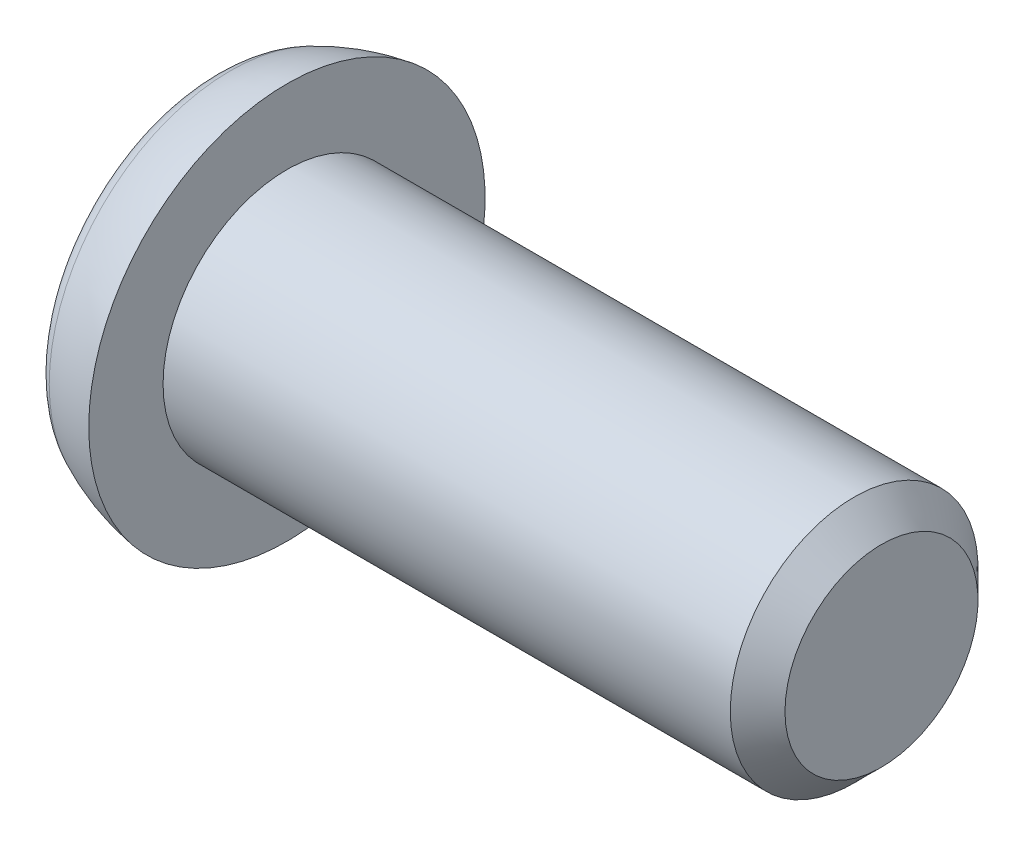
ISO-10303-21;
HEADER;
FILE_DESCRIPTION(('STEP AP214'),'2;1');
FILE_NAME('part.step','',(''),(''),'','','');
FILE_SCHEMA(('AUTOMOTIVE_DESIGN { 1 0 10303 214 1 1 1 1 }'));
ENDSEC;
DATA;
#1=APPLICATION_CONTEXT('core data for automotive mechanical design processes');
#2=APPLICATION_PROTOCOL_DEFINITION('international standard','automotive_design',2000,#1);
#3=PRODUCT_CONTEXT('',#1,'mechanical');
#4=PRODUCT('Part','Part','',(#3));
#5=PRODUCT_RELATED_PRODUCT_CATEGORY('part','',(#4));
#6=PRODUCT_DEFINITION_FORMATION('','',#4);
#7=PRODUCT_DEFINITION_CONTEXT('part definition',#1,'design');
#8=PRODUCT_DEFINITION('design','',#6,#7);
#9=PRODUCT_DEFINITION_SHAPE('','',#8);
#10=(LENGTH_UNIT() NAMED_UNIT(*) SI_UNIT(.MILLI.,.METRE.));
#11=(NAMED_UNIT(*) PLANE_ANGLE_UNIT() SI_UNIT($,.RADIAN.));
#12=(NAMED_UNIT(*) SI_UNIT($,.STERADIAN.) SOLID_ANGLE_UNIT());
#13=UNCERTAINTY_MEASURE_WITH_UNIT(LENGTH_MEASURE(1.E-05),#10,'distance_accuracy_value','');
#14=(GEOMETRIC_REPRESENTATION_CONTEXT(3) GLOBAL_UNCERTAINTY_ASSIGNED_CONTEXT((#13)) GLOBAL_UNIT_ASSIGNED_CONTEXT((#10,
#11,#12)) REPRESENTATION_CONTEXT('',''));
#15=CARTESIAN_POINT('',(0.,0.,0.));
#16=DIRECTION('',(0.,0.,1.));
#17=DIRECTION('',(1.,0.,0.));
#18=AXIS2_PLACEMENT_3D('',#15,#16,#17);
#19=CARTESIAN_POINT('',(-1.18104045222202,0.553965306488662,0.2));
#20=DIRECTION('',(0.,0.,-1.));
#21=DIRECTION('',(-1.,0.,0.));
#22=AXIS2_PLACEMENT_3D('',#19,#20,#21);
#23=CYLINDRICAL_SURFACE('',#22,1.59999999999999);
#24=CARTESIAN_POINT('',(-1.18104045222202,0.553965306488662,0.2));
#25=DIRECTION('',(0.,0.,1.));
#26=DIRECTION('',(1.,0.,0.));
#27=AXIS2_PLACEMENT_3D('',#24,#25,#26);
#28=CIRCLE('',#27,1.59999999999999);
#29=CARTESIAN_POINT('',(-0.8,-1.,0.2));
#30=VERTEX_POINT('',#29);
#31=CARTESIAN_POINT('',(0.230177573673136,-0.2,0.2));
#32=VERTEX_POINT('',#31);
#33=EDGE_CURVE('E193',#30,#32,#28,.T.);
#34=ORIENTED_EDGE('',*,*,#33,.T.);
#35=DIRECTION('',(0.,0.,-1.));
#36=VECTOR('',#35,1.);
#37=CARTESIAN_POINT('',(0.230177573673136,-0.2,0.2));
#38=LINE('',#37,#36);
#39=CARTESIAN_POINT('',(0.230177573673136,-0.2,-0.2));
#40=VERTEX_POINT('',#39);
#41=EDGE_CURVE('E136',#32,#40,#38,.T.);
#42=ORIENTED_EDGE('',*,*,#41,.T.);
#43=CARTESIAN_POINT('',(-1.18104045222202,0.553965306488662,-0.2));
#44=DIRECTION('',(0.,0.,1.));
#45=DIRECTION('',(1.,0.,0.));
#46=AXIS2_PLACEMENT_3D('',#43,#44,#45);
#47=CIRCLE('',#46,1.59999999999999);
#48=CARTESIAN_POINT('',(-0.8,-1.,-0.2));
#49=VERTEX_POINT('',#48);
#50=EDGE_CURVE('E182',#49,#40,#47,.T.);
#51=ORIENTED_EDGE('',*,*,#50,.F.);
#52=DIRECTION('',(0.,0.,-1.));
#53=VECTOR('',#52,1.);
#54=CARTESIAN_POINT('',(-0.8,-1.,0.2));
#55=LINE('',#54,#53);
#56=EDGE_CURVE('E204',#30,#49,#55,.T.);
#57=ORIENTED_EDGE('',*,*,#56,.F.);
#58=EDGE_LOOP('',(#34,#42,#51,#57));
#59=FACE_BOUND('',#58,.T.);
#60=ADVANCED_FACE('F36',(#59),#23,.F.);
#61=CARTESIAN_POINT('',(-1.18104045222202,0.553965306488662,0.2));
#62=DIRECTION('',(0.,0.,1.));
#63=DIRECTION('',(1.,0.,0.));
#64=AXIS2_PLACEMENT_3D('',#61,#62,#63);
#65=PLANE('',#64);
#66=DIRECTION('',(-1.,0.,0.));
#67=VECTOR('',#66,1.);
#68=CARTESIAN_POINT('',(-1.18104045222202,-0.2,0.2));
#69=LINE('',#68,#67);
#70=CARTESIAN_POINT('',(-0.8,-0.2,0.2));
#71=VERTEX_POINT('',#70);
#72=EDGE_CURVE('E165',#32,#71,#69,.T.);
#73=ORIENTED_EDGE('',*,*,#72,.F.);
#74=ORIENTED_EDGE('',*,*,#33,.F.);
#75=DIRECTION('',(0.,-1.,0.));
#76=VECTOR('',#75,1.);
#77=CARTESIAN_POINT('',(-0.8,1.,0.2));
#78=LINE('',#77,#76);
#79=EDGE_CURVE('E200',#71,#30,#78,.T.);
#80=ORIENTED_EDGE('',*,*,#79,.F.);
#81=EDGE_LOOP('',(#73,#74,#80));
#82=FACE_BOUND('',#81,.T.);
#83=ADVANCED_FACE('F282',(#82),#65,.F.);
#84=CARTESIAN_POINT('',(-1.18104045222202,0.553965306488662,-0.2));
#85=DIRECTION('',(0.,0.,1.));
#86=DIRECTION('',(1.,0.,0.));
#87=AXIS2_PLACEMENT_3D('',#84,#85,#86);
#88=PLANE('',#87);
#89=ORIENTED_EDGE('',*,*,#50,.T.);
#90=DIRECTION('',(-1.,0.,0.));
#91=VECTOR('',#90,1.);
#92=CARTESIAN_POINT('',(-1.18104045222202,-0.2,-0.2));
#93=LINE('',#92,#91);
#94=CARTESIAN_POINT('',(-0.8,-0.2,-0.2));
#95=VERTEX_POINT('',#94);
#96=EDGE_CURVE('E232',#40,#95,#93,.T.);
#97=ORIENTED_EDGE('',*,*,#96,.T.);
#98=DIRECTION('',(0.,-1.,0.));
#99=VECTOR('',#98,1.);
#100=CARTESIAN_POINT('',(-0.8,1.,-0.2));
#101=LINE('',#100,#99);
#102=EDGE_CURVE('E188',#95,#49,#101,.T.);
#103=ORIENTED_EDGE('',*,*,#102,.T.);
#104=EDGE_LOOP('',(#89,#97,#103));
#105=FACE_BOUND('',#104,.T.);
#106=ADVANCED_FACE('F288',(#105),#88,.T.);
#107=CARTESIAN_POINT('',(-0.8,0.,0.));
#108=DIRECTION('',(1.,0.,0.));
#109=DIRECTION('',(0.,0.,-1.));
#110=AXIS2_PLACEMENT_3D('',#107,#108,#109);
#111=PLANE('',#110);
#112=DIRECTION('',(0.,-1.,0.));
#113=VECTOR('',#112,1.);
#114=CARTESIAN_POINT('',(-0.8,0.2,-1.));
#115=LINE('',#114,#113);
#116=CARTESIAN_POINT('',(-0.8,0.2,-1.));
#117=VERTEX_POINT('',#116);
#118=CARTESIAN_POINT('',(-0.8,-0.2,-1.));
#119=VERTEX_POINT('',#118);
#120=EDGE_CURVE('E127',#117,#119,#115,.T.);
#121=ORIENTED_EDGE('',*,*,#120,.F.);
#122=DIRECTION('',(0.,0.,1.));
#123=VECTOR('',#122,1.);
#124=CARTESIAN_POINT('',(-0.8,0.2,-1.));
#125=LINE('',#124,#123);
#126=CARTESIAN_POINT('',(-0.8,0.2,-0.2));
#127=VERTEX_POINT('',#126);
#128=EDGE_CURVE('E155',#117,#127,#125,.T.);
#129=ORIENTED_EDGE('',*,*,#128,.T.);
#130=CARTESIAN_POINT('',(-0.8,1.,-0.2));
#131=VERTEX_POINT('',#130);
#132=EDGE_CURVE('E189',#131,#127,#101,.T.);
#133=ORIENTED_EDGE('',*,*,#132,.F.);
#134=DIRECTION('',(0.,0.,-1.));
#135=VECTOR('',#134,1.);
#136=CARTESIAN_POINT('',(-0.8,1.,0.2));
#137=LINE('',#136,#135);
#138=CARTESIAN_POINT('',(-0.8,1.,0.2));
#139=VERTEX_POINT('',#138);
#140=EDGE_CURVE('E207',#139,#131,#137,.T.);
#141=ORIENTED_EDGE('',*,*,#140,.F.);
#142=CARTESIAN_POINT('',(-0.8,0.2,0.2));
#143=VERTEX_POINT('',#142);
#144=EDGE_CURVE('E201',#139,#143,#78,.T.);
#145=ORIENTED_EDGE('',*,*,#144,.T.);
#146=CARTESIAN_POINT('',(-0.8,0.2,1.));
#147=VERTEX_POINT('',#146);
#148=EDGE_CURVE('E154',#143,#147,#125,.T.);
#149=ORIENTED_EDGE('',*,*,#148,.T.);
#150=DIRECTION('',(0.,-1.,0.));
#151=VECTOR('',#150,1.);
#152=CARTESIAN_POINT('',(-0.8,0.2,1.));
#153=LINE('',#152,#151);
#154=CARTESIAN_POINT('',(-0.8,-0.2,1.));
#155=VERTEX_POINT('',#154);
#156=EDGE_CURVE('E158',#147,#155,#153,.T.);
#157=ORIENTED_EDGE('',*,*,#156,.T.);
#158=DIRECTION('',(0.,0.,1.));
#159=VECTOR('',#158,1.);
#160=CARTESIAN_POINT('',(-0.8,-0.2,-1.));
#161=LINE('',#160,#159);
#162=EDGE_CURVE('E141',#71,#155,#161,.T.);
#163=ORIENTED_EDGE('',*,*,#162,.F.);
#164=ORIENTED_EDGE('',*,*,#79,.T.);
#165=ORIENTED_EDGE('',*,*,#56,.T.);
#166=ORIENTED_EDGE('',*,*,#102,.F.);
#167=EDGE_CURVE('E144',#119,#95,#161,.T.);
#168=ORIENTED_EDGE('',*,*,#167,.F.);
#169=EDGE_LOOP('',(#121,#129,#133,#141,#145,#149,#157,#163,#164,#165,#166,#168));
#170=FACE_BOUND('',#169,.T.);
#171=CARTESIAN_POINT('',(-0.8,0.,0.));
#172=DIRECTION('',(-1.,0.,0.));
#173=DIRECTION('',(0.,0.,1.));
#174=AXIS2_PLACEMENT_3D('',#171,#172,#173);
#175=CIRCLE('',#174,1.4660185501017);
#176=CARTESIAN_POINT('',(-0.8,0.,1.4660185501017));
#177=VERTEX_POINT('',#176);
#178=EDGE_CURVE('E229',#177,#177,#175,.T.);
#179=ORIENTED_EDGE('',*,*,#178,.T.);
#180=EDGE_LOOP('',(#179));
#181=FACE_BOUND('',#180,.T.);
#182=ADVANCED_FACE('F38',(#170,#181),#111,.F.);
#183=CARTESIAN_POINT('',(-0.399999999999956,0.,0.));
#184=DIRECTION('',(-1.,0.,0.));
#185=DIRECTION('',(0.,0.,1.));
#186=AXIS2_PLACEMENT_3D('',#183,#184,#185);
#187=TOROIDAL_SURFACE('',#186,1.46601855010163,0.400000000000044);
#188=ORIENTED_EDGE('',*,*,#178,.F.);
#189=EDGE_LOOP('',(#188));
#190=FACE_BOUND('',#189,.T.);
#191=CARTESIAN_POINT('',(-0.57150995157356,0.,0.));
#192=DIRECTION('',(-1.,0.,0.));
#193=DIRECTION('',(0.,0.,1.));
#194=AXIS2_PLACEMENT_3D('',#191,#192,#193);
#195=CIRCLE('',#194,1.8273830980463);
#196=CARTESIAN_POINT('',(-0.57150995157356,0.,1.8273830980463));
#197=VERTEX_POINT('',#196);
#198=EDGE_CURVE('E226',#197,#197,#195,.T.);
#199=ORIENTED_EDGE('',*,*,#198,.T.);
#200=EDGE_LOOP('',(#199));
#201=FACE_BOUND('',#200,.T.);
#202=ADVANCED_FACE('F357',(#190,#201),#187,.T.);
#203=CARTESIAN_POINT('',(0.286039856663423,0.,0.));
#204=DIRECTION('',(-1.,0.,0.));
#205=DIRECTION('',(0.,0.,1.));
#206=AXIS2_PLACEMENT_3D('',#203,#204,#205);
#207=DEGENERATE_TOROIDAL_SURFACE('',#206,0.0205603822311625,1.99999999999822,.T.);
#208=ORIENTED_EDGE('',*,*,#198,.F.);
#209=EDGE_LOOP('',(#208));
#210=FACE_BOUND('',#209,.T.);
#211=CARTESIAN_POINT('',(0.,0.,0.));
#212=DIRECTION('',(-1.,0.,0.));
#213=DIRECTION('',(0.,0.,1.));
#214=AXIS2_PLACEMENT_3D('',#211,#212,#213);
#215=CIRCLE('',#214,2.);
#216=CARTESIAN_POINT('',(0.,0.,2.));
#217=VERTEX_POINT('',#216);
#218=EDGE_CURVE('E223',#217,#217,#215,.T.);
#219=ORIENTED_EDGE('',*,*,#218,.T.);
#220=EDGE_LOOP('',(#219));
#221=FACE_BOUND('',#220,.T.);
#222=ADVANCED_FACE('F361',(#210,#221),#207,.T.);
#223=CARTESIAN_POINT('',(0.,2.,0.));
#224=DIRECTION('',(-1.,0.,0.));
#225=DIRECTION('',(0.,0.,1.));
#226=AXIS2_PLACEMENT_3D('',#223,#224,#225);
#227=PLANE('',#226);
#228=ORIENTED_EDGE('',*,*,#218,.F.);
#229=EDGE_LOOP('',(#228));
#230=FACE_BOUND('',#229,.T.);
#231=CARTESIAN_POINT('',(0.,0.,0.));
#232=DIRECTION('',(-1.,0.,0.));
#233=DIRECTION('',(0.,0.,1.));
#234=AXIS2_PLACEMENT_3D('',#231,#232,#233);
#235=CIRCLE('',#234,1.25);
#236=CARTESIAN_POINT('',(0.,0.,1.25));
#237=VERTEX_POINT('',#236);
#238=EDGE_CURVE('E220',#237,#237,#235,.T.);
#239=ORIENTED_EDGE('',*,*,#238,.T.);
#240=EDGE_LOOP('',(#239));
#241=FACE_BOUND('',#240,.T.);
#242=ADVANCED_FACE('F366',(#230,#241),#227,.F.);
#243=CARTESIAN_POINT('',(6.,0.,0.));
#244=DIRECTION('',(-1.,0.,0.));
#245=DIRECTION('',(0.,0.,1.));
#246=AXIS2_PLACEMENT_3D('',#243,#244,#245);
#247=CYLINDRICAL_SURFACE('',#246,1.25);
#248=ORIENTED_EDGE('',*,*,#238,.F.);
#249=EDGE_LOOP('',(#248));
#250=FACE_BOUND('',#249,.T.);
#251=CARTESIAN_POINT('',(5.724,0.,0.));
#252=DIRECTION('',(-1.,0.,0.));
#253=DIRECTION('',(0.,0.,1.));
#254=AXIS2_PLACEMENT_3D('',#251,#252,#253);
#255=CIRCLE('',#254,1.25);
#256=CARTESIAN_POINT('',(5.724,0.,1.25));
#257=VERTEX_POINT('',#256);
#258=EDGE_CURVE('E217',#257,#257,#255,.T.);
#259=ORIENTED_EDGE('',*,*,#258,.T.);
#260=EDGE_LOOP('',(#259));
#261=FACE_BOUND('',#260,.T.);
#262=ADVANCED_FACE('F374',(#250,#261),#247,.T.);
#263=CARTESIAN_POINT('',(6.,0.,0.));
#264=DIRECTION('',(-1.,0.,0.));
#265=DIRECTION('',(0.,0.,1.));
#266=AXIS2_PLACEMENT_3D('',#263,#264,#265);
#267=CONICAL_SURFACE('',#266,0.974,0.785398163397448);
#268=ORIENTED_EDGE('',*,*,#258,.F.);
#269=EDGE_LOOP('',(#268));
#270=FACE_BOUND('',#269,.T.);
#271=CARTESIAN_POINT('',(6.,0.,0.));
#272=DIRECTION('',(-1.,0.,0.));
#273=DIRECTION('',(0.,0.,1.));
#274=AXIS2_PLACEMENT_3D('',#271,#272,#273);
#275=CIRCLE('',#274,0.974);
#276=CARTESIAN_POINT('',(6.,0.,0.974));
#277=VERTEX_POINT('',#276);
#278=EDGE_CURVE('E214',#277,#277,#275,.T.);
#279=ORIENTED_EDGE('',*,*,#278,.T.);
#280=EDGE_LOOP('',(#279));
#281=FACE_BOUND('',#280,.T.);
#282=ADVANCED_FACE('F378',(#270,#281),#267,.T.);
#283=CARTESIAN_POINT('',(6.,0.974,0.));
#284=DIRECTION('',(-1.,0.,0.));
#285=DIRECTION('',(0.,0.,1.));
#286=AXIS2_PLACEMENT_3D('',#283,#284,#285);
#287=PLANE('',#286);
#288=ORIENTED_EDGE('',*,*,#278,.F.);
#289=EDGE_LOOP('',(#288));
#290=FACE_BOUND('',#289,.T.);
#291=ADVANCED_FACE('F338',(#290),#287,.F.);
#292=CARTESIAN_POINT('',(-1.18104045222202,-0.553965306488661,0.2));
#293=DIRECTION('',(0.,0.,-1.));
#294=DIRECTION('',(-1.,0.,0.));
#295=AXIS2_PLACEMENT_3D('',#292,#293,#294);
#296=CYLINDRICAL_SURFACE('',#295,1.59999999999999);
#297=DIRECTION('',(0.,0.,-1.));
#298=VECTOR('',#297,1.);
#299=CARTESIAN_POINT('',(0.230177573673136,0.2,0.2));
#300=LINE('',#299,#298);
#301=CARTESIAN_POINT('',(0.230177573673136,0.2,0.2));
#302=VERTEX_POINT('',#301);
#303=CARTESIAN_POINT('',(0.230177573673136,0.2,-0.2));
#304=VERTEX_POINT('',#303);
#305=EDGE_CURVE('E167',#302,#304,#300,.T.);
#306=ORIENTED_EDGE('',*,*,#305,.F.);
#307=CARTESIAN_POINT('',(-1.18104045222202,-0.553965306488661,0.2));
#308=DIRECTION('',(0.,0.,1.));
#309=DIRECTION('',(1.,0.,0.));
#310=AXIS2_PLACEMENT_3D('',#307,#308,#309);
#311=CIRCLE('',#310,1.59999999999999);
#312=EDGE_CURVE('E196',#302,#139,#311,.T.);
#313=ORIENTED_EDGE('',*,*,#312,.T.);
#314=ORIENTED_EDGE('',*,*,#140,.T.);
#315=CARTESIAN_POINT('',(-1.18104045222202,-0.553965306488661,-0.2));
#316=DIRECTION('',(0.,0.,1.));
#317=DIRECTION('',(1.,0.,0.));
#318=AXIS2_PLACEMENT_3D('',#315,#316,#317);
#319=CIRCLE('',#318,1.59999999999999);
#320=EDGE_CURVE('E184',#304,#131,#319,.T.);
#321=ORIENTED_EDGE('',*,*,#320,.F.);
#322=EDGE_LOOP('',(#306,#313,#314,#321));
#323=FACE_BOUND('',#322,.T.);
#324=ADVANCED_FACE('F250',(#323),#296,.F.);
#325=ORIENTED_EDGE('',*,*,#312,.F.);
#326=DIRECTION('',(-1.,0.,0.));
#327=VECTOR('',#326,1.);
#328=CARTESIAN_POINT('',(-1.18104045222202,0.2,0.2));
#329=LINE('',#328,#327);
#330=EDGE_CURVE('E170',#302,#143,#329,.T.);
#331=ORIENTED_EDGE('',*,*,#330,.T.);
#332=ORIENTED_EDGE('',*,*,#144,.F.);
#333=EDGE_LOOP('',(#325,#331,#332));
#334=FACE_BOUND('',#333,.T.);
#335=ADVANCED_FACE('F254',(#334),#65,.F.);
#336=DIRECTION('',(-1.,0.,0.));
#337=VECTOR('',#336,1.);
#338=CARTESIAN_POINT('',(-1.18104045222202,0.2,-0.2));
#339=LINE('',#338,#337);
#340=EDGE_CURVE('E44',#304,#127,#339,.T.);
#341=ORIENTED_EDGE('',*,*,#340,.F.);
#342=ORIENTED_EDGE('',*,*,#320,.T.);
#343=ORIENTED_EDGE('',*,*,#132,.T.);
#344=EDGE_LOOP('',(#341,#342,#343));
#345=FACE_BOUND('',#344,.T.);
#346=ADVANCED_FACE('F247',(#345),#88,.T.);
#347=CARTESIAN_POINT('',(-1.18104045222202,-0.2,-0.553965306488662));
#348=DIRECTION('',(0.,1.,0.));
#349=DIRECTION('',(0.,0.,1.));
#350=AXIS2_PLACEMENT_3D('',#347,#348,#349);
#351=PLANE('',#350);
#352=CARTESIAN_POINT('',(-1.18104045222202,-0.2,0.553965306488661));
#353=DIRECTION('',(0.,1.,0.));
#354=DIRECTION('',(0.,0.,1.));
#355=AXIS2_PLACEMENT_3D('',#352,#353,#354);
#356=CIRCLE('',#355,1.59999999999999);
#357=EDGE_CURVE('E142',#40,#119,#356,.T.);
#358=ORIENTED_EDGE('',*,*,#357,.T.);
#359=ORIENTED_EDGE('',*,*,#167,.T.);
#360=ORIENTED_EDGE('',*,*,#96,.F.);
#361=EDGE_LOOP('',(#358,#359,#360));
#362=FACE_BOUND('',#361,.T.);
#363=ADVANCED_FACE('F291',(#362),#351,.T.);
#364=CARTESIAN_POINT('',(-1.18104045222202,0.2,-0.553965306488662));
#365=DIRECTION('',(0.,1.,0.));
#366=DIRECTION('',(0.,0.,1.));
#367=AXIS2_PLACEMENT_3D('',#364,#365,#366);
#368=PLANE('',#367);
#369=ORIENTED_EDGE('',*,*,#340,.T.);
#370=ORIENTED_EDGE('',*,*,#128,.F.);
#371=CARTESIAN_POINT('',(-1.18104045222202,0.2,0.553965306488661));
#372=DIRECTION('',(0.,1.,0.));
#373=DIRECTION('',(0.,0.,1.));
#374=AXIS2_PLACEMENT_3D('',#371,#372,#373);
#375=CIRCLE('',#374,1.59999999999999);
#376=EDGE_CURVE('E58',#304,#117,#375,.T.);
#377=ORIENTED_EDGE('',*,*,#376,.F.);
#378=EDGE_LOOP('',(#369,#370,#377));
#379=FACE_BOUND('',#378,.T.);
#380=ADVANCED_FACE('F238',(#379),#368,.F.);
#381=CARTESIAN_POINT('',(-1.18104045222202,0.2,0.553965306488661));
#382=DIRECTION('',(0.,-1.,0.));
#383=DIRECTION('',(0.,0.,-1.));
#384=AXIS2_PLACEMENT_3D('',#381,#382,#383);
#385=CYLINDRICAL_SURFACE('',#384,1.59999999999999);
#386=ORIENTED_EDGE('',*,*,#376,.T.);
#387=ORIENTED_EDGE('',*,*,#120,.T.);
#388=ORIENTED_EDGE('',*,*,#357,.F.);
#389=DIRECTION('',(0.,-1.,0.));
#390=VECTOR('',#389,1.);
#391=CARTESIAN_POINT('',(0.230177573673136,0.2,-0.2));
#392=LINE('',#391,#390);
#393=EDGE_CURVE('E235',#304,#40,#392,.T.);
#394=ORIENTED_EDGE('',*,*,#393,.F.);
#395=EDGE_LOOP('',(#386,#387,#388,#394));
#396=FACE_BOUND('',#395,.T.);
#397=ADVANCED_FACE('F293',(#396),#385,.F.);
#398=CARTESIAN_POINT('',(0.32,0.,-0.2));
#399=VERTEX_POINT('',#398);
#400=EDGE_CURVE('E185',#399,#304,#319,.T.);
#401=ORIENTED_EDGE('',*,*,#400,.T.);
#402=ORIENTED_EDGE('',*,*,#393,.T.);
#403=EDGE_CURVE('E181',#40,#399,#47,.T.);
#404=ORIENTED_EDGE('',*,*,#403,.T.);
#405=EDGE_LOOP('',(#401,#402,#404));
#406=FACE_BOUND('',#405,.T.);
#407=ADVANCED_FACE('F296',(#406),#88,.T.);
#408=DIRECTION('',(0.,0.,-1.));
#409=VECTOR('',#408,1.);
#410=CARTESIAN_POINT('',(0.32,0.,0.2));
#411=LINE('',#410,#409);
#412=CARTESIAN_POINT('',(0.32,0.,0.));
#413=VERTEX_POINT('',#412);
#414=EDGE_CURVE('E210',#413,#399,#411,.T.);
#415=ORIENTED_EDGE('',*,*,#414,.F.);
#416=CARTESIAN_POINT('',(-1.18104045222202,-0.553965306488661,0.553965306488661));
#417=DIRECTION('',(0.,-0.707106781186547,-0.707106781186547));
#418=DIRECTION('',(0.,0.707106781186547,-0.707106781186547));
#419=AXIS2_PLACEMENT_3D('',#416,#417,#418);
#420=ELLIPSE('',#419,2.26274169979693,1.59999999999999);
#421=EDGE_CURVE('E173',#413,#304,#420,.F.);
#422=ORIENTED_EDGE('',*,*,#421,.T.);
#423=ORIENTED_EDGE('',*,*,#400,.F.);
#424=EDGE_LOOP('',(#415,#422,#423));
#425=FACE_BOUND('',#424,.T.);
#426=ADVANCED_FACE('F300',(#425),#296,.F.);
#427=ORIENTED_EDGE('',*,*,#403,.F.);
#428=CARTESIAN_POINT('',(-1.18104045222202,0.553965306488662,0.553965306488661));
#429=DIRECTION('',(0.,0.707106781186547,-0.707106781186547));
#430=DIRECTION('',(0.,-0.707106781186547,-0.707106781186547));
#431=AXIS2_PLACEMENT_3D('',#428,#429,#430);
#432=ELLIPSE('',#431,2.26274169979693,1.59999999999999);
#433=EDGE_CURVE('E140',#40,#413,#432,.F.);
#434=ORIENTED_EDGE('',*,*,#433,.T.);
#435=ORIENTED_EDGE('',*,*,#414,.T.);
#436=EDGE_LOOP('',(#427,#434,#435));
#437=FACE_BOUND('',#436,.T.);
#438=ADVANCED_FACE('F316',(#437),#23,.F.);
#439=ORIENTED_EDGE('',*,*,#72,.T.);
#440=ORIENTED_EDGE('',*,*,#162,.T.);
#441=CARTESIAN_POINT('',(-1.18104045222202,-0.2,-0.553965306488662));
#442=DIRECTION('',(0.,1.,0.));
#443=DIRECTION('',(0.,0.,1.));
#444=AXIS2_PLACEMENT_3D('',#441,#442,#443);
#445=CIRCLE('',#444,1.59999999999999);
#446=EDGE_CURVE('E51',#155,#32,#445,.T.);
#447=ORIENTED_EDGE('',*,*,#446,.T.);
#448=EDGE_LOOP('',(#439,#440,#447));
#449=FACE_BOUND('',#448,.T.);
#450=ADVANCED_FACE('F326',(#449),#351,.T.);
#451=CARTESIAN_POINT('',(-1.18104045222202,0.2,-0.553965306488662));
#452=DIRECTION('',(0.,1.,0.));
#453=DIRECTION('',(0.,0.,1.));
#454=AXIS2_PLACEMENT_3D('',#451,#452,#453);
#455=CIRCLE('',#454,1.59999999999999);
#456=EDGE_CURVE('E148',#147,#302,#455,.T.);
#457=ORIENTED_EDGE('',*,*,#456,.F.);
#458=ORIENTED_EDGE('',*,*,#148,.F.);
#459=ORIENTED_EDGE('',*,*,#330,.F.);
#460=EDGE_LOOP('',(#457,#458,#459));
#461=FACE_BOUND('',#460,.T.);
#462=ADVANCED_FACE('F259',(#461),#368,.F.);
#463=CARTESIAN_POINT('',(-1.18104045222202,0.2,-0.553965306488662));
#464=DIRECTION('',(0.,-1.,0.));
#465=DIRECTION('',(0.,0.,-1.));
#466=AXIS2_PLACEMENT_3D('',#463,#464,#465);
#467=CYLINDRICAL_SURFACE('',#466,1.59999999999999);
#468=DIRECTION('',(0.,-1.,0.));
#469=VECTOR('',#468,1.);
#470=CARTESIAN_POINT('',(0.230177573673136,0.2,0.2));
#471=LINE('',#470,#469);
#472=EDGE_CURVE('E11',#302,#32,#471,.T.);
#473=ORIENTED_EDGE('',*,*,#472,.T.);
#474=ORIENTED_EDGE('',*,*,#446,.F.);
#475=ORIENTED_EDGE('',*,*,#156,.F.);
#476=ORIENTED_EDGE('',*,*,#456,.T.);
#477=EDGE_LOOP('',(#473,#474,#475,#476));
#478=FACE_BOUND('',#477,.T.);
#479=ADVANCED_FACE('F276',(#478),#467,.F.);
#480=ORIENTED_EDGE('',*,*,#472,.F.);
#481=CARTESIAN_POINT('',(0.32,0.,0.2));
#482=VERTEX_POINT('',#481);
#483=EDGE_CURVE('E197',#482,#302,#311,.T.);
#484=ORIENTED_EDGE('',*,*,#483,.F.);
#485=EDGE_CURVE('E192',#32,#482,#28,.T.);
#486=ORIENTED_EDGE('',*,*,#485,.F.);
#487=EDGE_LOOP('',(#480,#484,#486));
#488=FACE_BOUND('',#487,.T.);
#489=ADVANCED_FACE('F274',(#488),#65,.F.);
#490=ORIENTED_EDGE('',*,*,#483,.T.);
#491=CARTESIAN_POINT('',(-1.18104045222202,-0.553965306488661,-0.553965306488662));
#492=DIRECTION('',(0.,0.707106781186547,-0.707106781186547));
#493=DIRECTION('',(0.,-0.707106781186547,-0.707106781186547));
#494=AXIS2_PLACEMENT_3D('',#491,#492,#493);
#495=ELLIPSE('',#494,2.26274169979693,1.59999999999999);
#496=EDGE_CURVE('E177',#302,#413,#495,.T.);
#497=ORIENTED_EDGE('',*,*,#496,.T.);
#498=EDGE_CURVE('E211',#482,#413,#411,.T.);
#499=ORIENTED_EDGE('',*,*,#498,.F.);
#500=EDGE_LOOP('',(#490,#497,#499));
#501=FACE_BOUND('',#500,.T.);
#502=ADVANCED_FACE('F271',(#501),#296,.F.);
#503=ORIENTED_EDGE('',*,*,#498,.T.);
#504=CARTESIAN_POINT('',(-1.18104045222202,0.553965306488662,-0.553965306488662));
#505=DIRECTION('',(0.,-0.707106781186547,-0.707106781186547));
#506=DIRECTION('',(0.,0.707106781186547,-0.707106781186547));
#507=AXIS2_PLACEMENT_3D('',#504,#505,#506);
#508=ELLIPSE('',#507,2.26274169979693,1.59999999999999);
#509=EDGE_CURVE('E121',#413,#32,#508,.T.);
#510=ORIENTED_EDGE('',*,*,#509,.T.);
#511=ORIENTED_EDGE('',*,*,#485,.T.);
#512=EDGE_LOOP('',(#503,#510,#511));
#513=FACE_BOUND('',#512,.T.);
#514=ADVANCED_FACE('F310',(#513),#23,.F.);
#515=ORIENTED_EDGE('',*,*,#305,.T.);
#516=CARTESIAN_POINT('',(0.32,0.2,0.));
#517=VERTEX_POINT('',#516);
#518=EDGE_CURVE('E151',#517,#304,#375,.T.);
#519=ORIENTED_EDGE('',*,*,#518,.F.);
#520=EDGE_CURVE('E147',#302,#517,#455,.T.);
#521=ORIENTED_EDGE('',*,*,#520,.F.);
#522=EDGE_LOOP('',(#515,#519,#521));
#523=FACE_BOUND('',#522,.T.);
#524=ADVANCED_FACE('F268',(#523),#368,.F.);
#525=DIRECTION('',(0.,-1.,0.));
#526=VECTOR('',#525,1.);
#527=CARTESIAN_POINT('',(0.32,0.2,0.));
#528=LINE('',#527,#526);
#529=EDGE_CURVE('E126',#517,#413,#528,.T.);
#530=ORIENTED_EDGE('',*,*,#529,.F.);
#531=ORIENTED_EDGE('',*,*,#518,.T.);
#532=ORIENTED_EDGE('',*,*,#421,.F.);
#533=EDGE_LOOP('',(#530,#531,#532));
#534=FACE_BOUND('',#533,.T.);
#535=ADVANCED_FACE('F302',(#534),#385,.F.);
#536=ORIENTED_EDGE('',*,*,#520,.T.);
#537=ORIENTED_EDGE('',*,*,#529,.T.);
#538=ORIENTED_EDGE('',*,*,#496,.F.);
#539=EDGE_LOOP('',(#536,#537,#538));
#540=FACE_BOUND('',#539,.T.);
#541=ADVANCED_FACE('F262',(#540),#467,.F.);
#542=CARTESIAN_POINT('',(0.32,-0.2,0.));
#543=VERTEX_POINT('',#542);
#544=EDGE_CURVE('E115',#413,#543,#528,.T.);
#545=ORIENTED_EDGE('',*,*,#544,.T.);
#546=EDGE_CURVE('E118',#32,#543,#445,.T.);
#547=ORIENTED_EDGE('',*,*,#546,.F.);
#548=ORIENTED_EDGE('',*,*,#509,.F.);
#549=EDGE_LOOP('',(#545,#547,#548));
#550=FACE_BOUND('',#549,.T.);
#551=ADVANCED_FACE('F117',(#550),#467,.F.);
#552=EDGE_CURVE('E133',#543,#40,#356,.T.);
#553=ORIENTED_EDGE('',*,*,#552,.F.);
#554=ORIENTED_EDGE('',*,*,#544,.F.);
#555=ORIENTED_EDGE('',*,*,#433,.F.);
#556=EDGE_LOOP('',(#553,#554,#555));
#557=FACE_BOUND('',#556,.T.);
#558=ADVANCED_FACE('F138',(#557),#385,.F.);
#559=ORIENTED_EDGE('',*,*,#546,.T.);
#560=ORIENTED_EDGE('',*,*,#552,.T.);
#561=ORIENTED_EDGE('',*,*,#41,.F.);
#562=EDGE_LOOP('',(#559,#560,#561));
#563=FACE_BOUND('',#562,.T.);
#564=ADVANCED_FACE('F132',(#563),#351,.T.);
#565=CLOSED_SHELL('',(#60,#83,#106,#182,#202,#222,#242,#262,#282,#291,#324,#335,#346,#363,#380,
#397,#407,#426,#438,#450,#462,#479,#489,#502,#514,#524,#535,#541,#551,#558,#564));
#566=MANIFOLD_SOLID_BREP('B2',#565);
#567=ADVANCED_BREP_SHAPE_REPRESENTATION('',(#18,#566),#14);
#568=SHAPE_DEFINITION_REPRESENTATION(#9,#567);
ENDSEC;
END-ISO-10303-21;
